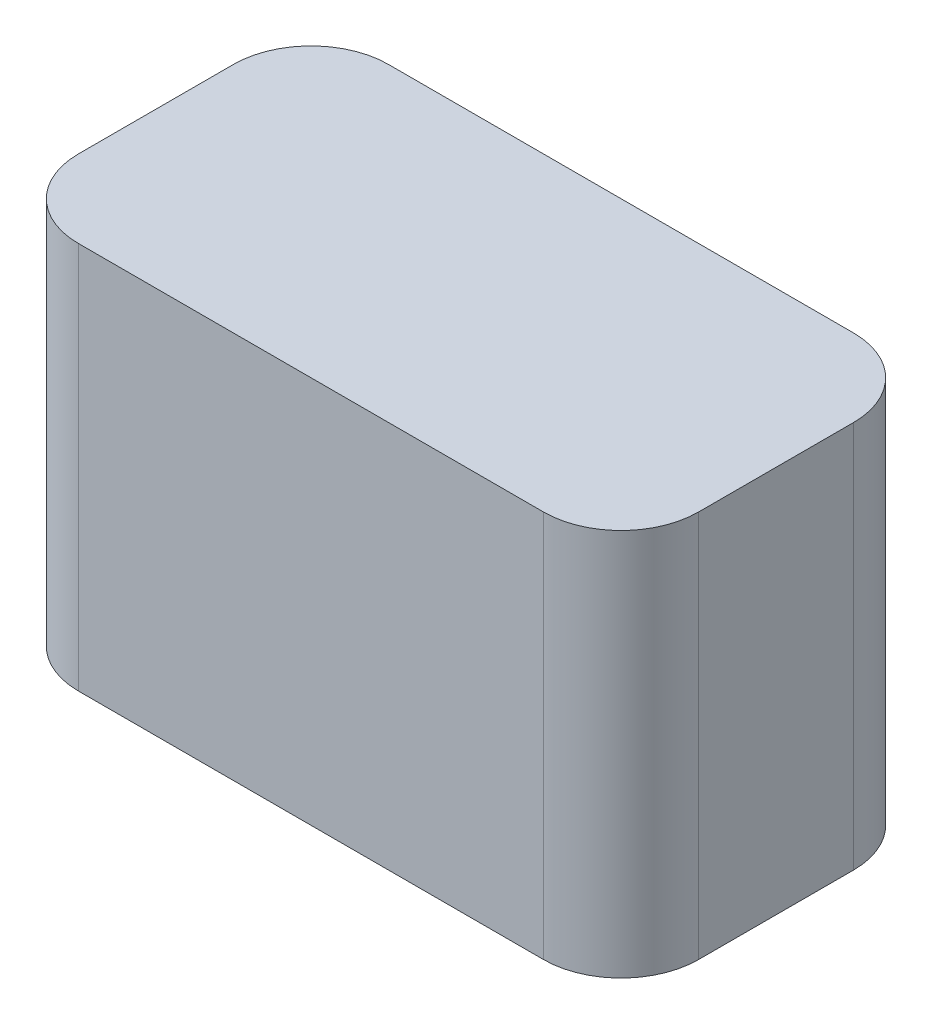
ISO-10303-21;
HEADER;
FILE_DESCRIPTION(('STEP AP214'),'2;1');
FILE_NAME('part.step','',(''),(''),'','','');
FILE_SCHEMA(('AUTOMOTIVE_DESIGN { 1 0 10303 214 1 1 1 1 }'));
ENDSEC;
DATA;
#1=APPLICATION_CONTEXT('core data for automotive mechanical design processes');
#2=APPLICATION_PROTOCOL_DEFINITION('international standard','automotive_design',2000,#1);
#3=PRODUCT_CONTEXT('',#1,'mechanical');
#4=PRODUCT('Part','Part','',(#3));
#5=PRODUCT_RELATED_PRODUCT_CATEGORY('part','',(#4));
#6=PRODUCT_DEFINITION_FORMATION('','',#4);
#7=PRODUCT_DEFINITION_CONTEXT('part definition',#1,'design');
#8=PRODUCT_DEFINITION('design','',#6,#7);
#9=PRODUCT_DEFINITION_SHAPE('','',#8);
#10=(LENGTH_UNIT() NAMED_UNIT(*) SI_UNIT(.MILLI.,.METRE.));
#11=(NAMED_UNIT(*) PLANE_ANGLE_UNIT() SI_UNIT($,.RADIAN.));
#12=(NAMED_UNIT(*) SI_UNIT($,.STERADIAN.) SOLID_ANGLE_UNIT());
#13=UNCERTAINTY_MEASURE_WITH_UNIT(LENGTH_MEASURE(1.E-05),#10,'distance_accuracy_value','');
#14=(GEOMETRIC_REPRESENTATION_CONTEXT(3) GLOBAL_UNCERTAINTY_ASSIGNED_CONTEXT((#13)) GLOBAL_UNIT_ASSIGNED_CONTEXT((#10,
#11,#12)) REPRESENTATION_CONTEXT('',''));
#15=CARTESIAN_POINT('',(0.,0.,0.));
#16=DIRECTION('',(0.,0.,1.));
#17=DIRECTION('',(1.,0.,0.));
#18=AXIS2_PLACEMENT_3D('',#15,#16,#17);
#19=CARTESIAN_POINT('',(-3.,5.,-1.));
#20=DIRECTION('',(0.,-1.,0.));
#21=DIRECTION('',(0.,0.,-1.));
#22=AXIS2_PLACEMENT_3D('',#19,#20,#21);
#23=CYLINDRICAL_SURFACE('',#22,1.);
#24=CARTESIAN_POINT('',(-3.,0.,-1.));
#25=DIRECTION('',(0.,1.,0.));
#26=DIRECTION('',(0.,0.,1.));
#27=AXIS2_PLACEMENT_3D('',#24,#25,#26);
#28=CIRCLE('',#27,1.);
#29=CARTESIAN_POINT('',(-2.99999999999999,0.,-2.));
#30=VERTEX_POINT('',#29);
#31=CARTESIAN_POINT('',(-4.,0.,-0.999999999999994));
#32=VERTEX_POINT('',#31);
#33=EDGE_CURVE('E129',#30,#32,#28,.T.);
#34=ORIENTED_EDGE('',*,*,#33,.T.);
#35=DIRECTION('',(0.,-1.,0.));
#36=VECTOR('',#35,1.);
#37=CARTESIAN_POINT('',(-4.,5.,-0.999999999999994));
#38=LINE('',#37,#36);
#39=CARTESIAN_POINT('',(-4.,5.,-0.999999999999994));
#40=VERTEX_POINT('',#39);
#41=EDGE_CURVE('E11',#40,#32,#38,.T.);
#42=ORIENTED_EDGE('',*,*,#41,.F.);
#43=CARTESIAN_POINT('',(-3.,5.,-1.));
#44=DIRECTION('',(0.,1.,0.));
#45=DIRECTION('',(0.,0.,1.));
#46=AXIS2_PLACEMENT_3D('',#43,#44,#45);
#47=CIRCLE('',#46,1.);
#48=CARTESIAN_POINT('',(-2.99999999999999,5.,-2.));
#49=VERTEX_POINT('',#48);
#50=EDGE_CURVE('E143',#49,#40,#47,.T.);
#51=ORIENTED_EDGE('',*,*,#50,.F.);
#52=DIRECTION('',(0.,-1.,0.));
#53=VECTOR('',#52,1.);
#54=CARTESIAN_POINT('',(-2.99999999999999,5.,-2.));
#55=LINE('',#54,#53);
#56=EDGE_CURVE('E125',#49,#30,#55,.T.);
#57=ORIENTED_EDGE('',*,*,#56,.T.);
#58=EDGE_LOOP('',(#34,#42,#51,#57));
#59=FACE_BOUND('',#58,.T.);
#60=ADVANCED_FACE('F33',(#59),#23,.T.);
#61=CARTESIAN_POINT('',(-4.,5.,-0.999999999999994));
#62=DIRECTION('',(1.,0.,0.));
#63=DIRECTION('',(0.,0.,-1.));
#64=AXIS2_PLACEMENT_3D('',#61,#62,#63);
#65=PLANE('',#64);
#66=DIRECTION('',(0.,0.,1.));
#67=VECTOR('',#66,1.);
#68=CARTESIAN_POINT('',(-4.,0.,-0.999999999999994));
#69=LINE('',#68,#67);
#70=CARTESIAN_POINT('',(-4.,0.,0.999999999999992));
#71=VERTEX_POINT('',#70);
#72=EDGE_CURVE('E132',#32,#71,#69,.T.);
#73=ORIENTED_EDGE('',*,*,#72,.T.);
#74=DIRECTION('',(0.,-1.,0.));
#75=VECTOR('',#74,1.);
#76=CARTESIAN_POINT('',(-4.,5.,0.999999999999992));
#77=LINE('',#76,#75);
#78=CARTESIAN_POINT('',(-4.,5.,0.999999999999992));
#79=VERTEX_POINT('',#78);
#80=EDGE_CURVE('E41',#79,#71,#77,.T.);
#81=ORIENTED_EDGE('',*,*,#80,.F.);
#82=DIRECTION('',(0.,0.,1.));
#83=VECTOR('',#82,1.);
#84=CARTESIAN_POINT('',(-4.,5.,-0.999999999999994));
#85=LINE('',#84,#83);
#86=EDGE_CURVE('E92',#40,#79,#85,.T.);
#87=ORIENTED_EDGE('',*,*,#86,.F.);
#88=ORIENTED_EDGE('',*,*,#41,.T.);
#89=EDGE_LOOP('',(#73,#81,#87,#88));
#90=FACE_BOUND('',#89,.T.);
#91=ADVANCED_FACE('F178',(#90),#65,.F.);
#92=CARTESIAN_POINT('',(-3.,5.,0.999999999999999));
#93=DIRECTION('',(0.,-1.,0.));
#94=DIRECTION('',(0.,0.,-1.));
#95=AXIS2_PLACEMENT_3D('',#92,#93,#94);
#96=CYLINDRICAL_SURFACE('',#95,1.);
#97=CARTESIAN_POINT('',(-3.,0.,0.999999999999999));
#98=DIRECTION('',(0.,1.,0.));
#99=DIRECTION('',(0.,0.,1.));
#100=AXIS2_PLACEMENT_3D('',#97,#98,#99);
#101=CIRCLE('',#100,1.);
#102=CARTESIAN_POINT('',(-2.99999999999999,0.,2.));
#103=VERTEX_POINT('',#102);
#104=EDGE_CURVE('E134',#71,#103,#101,.T.);
#105=ORIENTED_EDGE('',*,*,#104,.T.);
#106=DIRECTION('',(0.,-1.,0.));
#107=VECTOR('',#106,1.);
#108=CARTESIAN_POINT('',(-2.99999999999999,5.,2.));
#109=LINE('',#108,#107);
#110=CARTESIAN_POINT('',(-2.99999999999999,5.,2.));
#111=VERTEX_POINT('',#110);
#112=EDGE_CURVE('E150',#111,#103,#109,.T.);
#113=ORIENTED_EDGE('',*,*,#112,.F.);
#114=CARTESIAN_POINT('',(-3.,5.,0.999999999999999));
#115=DIRECTION('',(0.,1.,0.));
#116=DIRECTION('',(0.,0.,1.));
#117=AXIS2_PLACEMENT_3D('',#114,#115,#116);
#118=CIRCLE('',#117,1.);
#119=EDGE_CURVE('E158',#79,#111,#118,.T.);
#120=ORIENTED_EDGE('',*,*,#119,.F.);
#121=ORIENTED_EDGE('',*,*,#80,.T.);
#122=EDGE_LOOP('',(#105,#113,#120,#121));
#123=FACE_BOUND('',#122,.T.);
#124=ADVANCED_FACE('F156',(#123),#96,.T.);
#125=CARTESIAN_POINT('',(-2.99999999999999,5.,2.));
#126=DIRECTION('',(0.,0.,-1.));
#127=DIRECTION('',(-1.,0.,0.));
#128=AXIS2_PLACEMENT_3D('',#125,#126,#127);
#129=PLANE('',#128);
#130=DIRECTION('',(1.,0.,0.));
#131=VECTOR('',#130,1.);
#132=CARTESIAN_POINT('',(-2.99999999999999,0.,2.));
#133=LINE('',#132,#131);
#134=CARTESIAN_POINT('',(2.99999999999999,0.,2.));
#135=VERTEX_POINT('',#134);
#136=EDGE_CURVE('E136',#103,#135,#133,.T.);
#137=ORIENTED_EDGE('',*,*,#136,.T.);
#138=DIRECTION('',(0.,-1.,0.));
#139=VECTOR('',#138,1.);
#140=CARTESIAN_POINT('',(2.99999999999999,5.,2.));
#141=LINE('',#140,#139);
#142=CARTESIAN_POINT('',(2.99999999999999,5.,2.));
#143=VERTEX_POINT('',#142);
#144=EDGE_CURVE('E147',#143,#135,#141,.T.);
#145=ORIENTED_EDGE('',*,*,#144,.F.);
#146=DIRECTION('',(1.,0.,0.));
#147=VECTOR('',#146,1.);
#148=CARTESIAN_POINT('',(-2.99999999999999,5.,2.));
#149=LINE('',#148,#147);
#150=EDGE_CURVE('E170',#111,#143,#149,.T.);
#151=ORIENTED_EDGE('',*,*,#150,.F.);
#152=ORIENTED_EDGE('',*,*,#112,.T.);
#153=EDGE_LOOP('',(#137,#145,#151,#152));
#154=FACE_BOUND('',#153,.T.);
#155=ADVANCED_FACE('F166',(#154),#129,.F.);
#156=CARTESIAN_POINT('',(3.,5.,0.999999999999999));
#157=DIRECTION('',(0.,-1.,0.));
#158=DIRECTION('',(0.,0.,-1.));
#159=AXIS2_PLACEMENT_3D('',#156,#157,#158);
#160=CYLINDRICAL_SURFACE('',#159,1.);
#161=CARTESIAN_POINT('',(3.,0.,0.999999999999999));
#162=DIRECTION('',(0.,1.,0.));
#163=DIRECTION('',(0.,0.,-1.));
#164=AXIS2_PLACEMENT_3D('',#161,#162,#163);
#165=CIRCLE('',#164,1.);
#166=CARTESIAN_POINT('',(4.,0.,0.999999999999992));
#167=VERTEX_POINT('',#166);
#168=EDGE_CURVE('E138',#135,#167,#165,.T.);
#169=ORIENTED_EDGE('',*,*,#168,.T.);
#170=DIRECTION('',(0.,-1.,0.));
#171=VECTOR('',#170,1.);
#172=CARTESIAN_POINT('',(4.,5.,0.999999999999992));
#173=LINE('',#172,#171);
#174=CARTESIAN_POINT('',(4.,5.,0.999999999999992));
#175=VERTEX_POINT('',#174);
#176=EDGE_CURVE('E120',#175,#167,#173,.T.);
#177=ORIENTED_EDGE('',*,*,#176,.F.);
#178=CARTESIAN_POINT('',(3.,5.,0.999999999999999));
#179=DIRECTION('',(0.,1.,0.));
#180=DIRECTION('',(0.,0.,-1.));
#181=AXIS2_PLACEMENT_3D('',#178,#179,#180);
#182=CIRCLE('',#181,1.);
#183=EDGE_CURVE('E111',#143,#175,#182,.T.);
#184=ORIENTED_EDGE('',*,*,#183,.F.);
#185=ORIENTED_EDGE('',*,*,#144,.T.);
#186=EDGE_LOOP('',(#169,#177,#184,#185));
#187=FACE_BOUND('',#186,.T.);
#188=ADVANCED_FACE('F169',(#187),#160,.T.);
#189=CARTESIAN_POINT('',(4.,5.,-0.999999999999994));
#190=DIRECTION('',(-1.,0.,0.));
#191=DIRECTION('',(0.,0.,1.));
#192=AXIS2_PLACEMENT_3D('',#189,#190,#191);
#193=PLANE('',#192);
#194=DIRECTION('',(0.,0.,-1.));
#195=VECTOR('',#194,1.);
#196=CARTESIAN_POINT('',(4.,0.,-0.999999999999994));
#197=LINE('',#196,#195);
#198=CARTESIAN_POINT('',(4.,0.,-0.999999999999994));
#199=VERTEX_POINT('',#198);
#200=EDGE_CURVE('E119',#167,#199,#197,.T.);
#201=ORIENTED_EDGE('',*,*,#200,.T.);
#202=DIRECTION('',(0.,-1.,0.));
#203=VECTOR('',#202,1.);
#204=CARTESIAN_POINT('',(4.,5.,-0.999999999999994));
#205=LINE('',#204,#203);
#206=CARTESIAN_POINT('',(4.,5.,-0.999999999999994));
#207=VERTEX_POINT('',#206);
#208=EDGE_CURVE('E116',#207,#199,#205,.T.);
#209=ORIENTED_EDGE('',*,*,#208,.F.);
#210=DIRECTION('',(0.,0.,-1.));
#211=VECTOR('',#210,1.);
#212=CARTESIAN_POINT('',(4.,5.,-0.999999999999994));
#213=LINE('',#212,#211);
#214=EDGE_CURVE('E105',#175,#207,#213,.T.);
#215=ORIENTED_EDGE('',*,*,#214,.F.);
#216=ORIENTED_EDGE('',*,*,#176,.T.);
#217=EDGE_LOOP('',(#201,#209,#215,#216));
#218=FACE_BOUND('',#217,.T.);
#219=ADVANCED_FACE('F117',(#218),#193,.F.);
#220=CARTESIAN_POINT('',(3.,5.,-1.));
#221=DIRECTION('',(0.,-1.,0.));
#222=DIRECTION('',(0.,0.,-1.));
#223=AXIS2_PLACEMENT_3D('',#220,#221,#222);
#224=CYLINDRICAL_SURFACE('',#223,1.);
#225=CARTESIAN_POINT('',(3.,0.,-1.));
#226=DIRECTION('',(0.,1.,0.));
#227=DIRECTION('',(0.,0.,-1.));
#228=AXIS2_PLACEMENT_3D('',#225,#226,#227);
#229=CIRCLE('',#228,1.);
#230=CARTESIAN_POINT('',(2.99999999999999,0.,-2.));
#231=VERTEX_POINT('',#230);
#232=EDGE_CURVE('E78',#199,#231,#229,.T.);
#233=ORIENTED_EDGE('',*,*,#232,.T.);
#234=DIRECTION('',(0.,-1.,0.));
#235=VECTOR('',#234,1.);
#236=CARTESIAN_POINT('',(2.99999999999999,5.,-2.));
#237=LINE('',#236,#235);
#238=CARTESIAN_POINT('',(2.99999999999999,5.,-2.));
#239=VERTEX_POINT('',#238);
#240=EDGE_CURVE('E121',#239,#231,#237,.T.);
#241=ORIENTED_EDGE('',*,*,#240,.F.);
#242=CARTESIAN_POINT('',(3.,5.,-1.));
#243=DIRECTION('',(0.,1.,0.));
#244=DIRECTION('',(0.,0.,-1.));
#245=AXIS2_PLACEMENT_3D('',#242,#243,#244);
#246=CIRCLE('',#245,1.);
#247=EDGE_CURVE('E109',#207,#239,#246,.T.);
#248=ORIENTED_EDGE('',*,*,#247,.F.);
#249=ORIENTED_EDGE('',*,*,#208,.T.);
#250=EDGE_LOOP('',(#233,#241,#248,#249));
#251=FACE_BOUND('',#250,.T.);
#252=ADVANCED_FACE('F123',(#251),#224,.T.);
#253=CARTESIAN_POINT('',(-2.99999999999999,5.,-2.));
#254=DIRECTION('',(0.,0.,1.));
#255=DIRECTION('',(1.,0.,0.));
#256=AXIS2_PLACEMENT_3D('',#253,#254,#255);
#257=PLANE('',#256);
#258=DIRECTION('',(-1.,0.,0.));
#259=VECTOR('',#258,1.);
#260=CARTESIAN_POINT('',(-2.99999999999999,0.,-2.));
#261=LINE('',#260,#259);
#262=EDGE_CURVE('E84',#231,#30,#261,.T.);
#263=ORIENTED_EDGE('',*,*,#262,.T.);
#264=ORIENTED_EDGE('',*,*,#56,.F.);
#265=DIRECTION('',(-1.,0.,0.));
#266=VECTOR('',#265,1.);
#267=CARTESIAN_POINT('',(-2.99999999999999,5.,-2.));
#268=LINE('',#267,#266);
#269=EDGE_CURVE('E49',#239,#49,#268,.T.);
#270=ORIENTED_EDGE('',*,*,#269,.F.);
#271=ORIENTED_EDGE('',*,*,#240,.T.);
#272=EDGE_LOOP('',(#263,#264,#270,#271));
#273=FACE_BOUND('',#272,.T.);
#274=ADVANCED_FACE('F194',(#273),#257,.F.);
#275=CARTESIAN_POINT('',(-3.,5.,-1.));
#276=DIRECTION('',(0.,1.,0.));
#277=DIRECTION('',(0.,0.,1.));
#278=AXIS2_PLACEMENT_3D('',#275,#276,#277);
#279=PLANE('',#278);
#280=ORIENTED_EDGE('',*,*,#50,.T.);
#281=ORIENTED_EDGE('',*,*,#86,.T.);
#282=ORIENTED_EDGE('',*,*,#119,.T.);
#283=ORIENTED_EDGE('',*,*,#150,.T.);
#284=ORIENTED_EDGE('',*,*,#183,.T.);
#285=ORIENTED_EDGE('',*,*,#214,.T.);
#286=ORIENTED_EDGE('',*,*,#247,.T.);
#287=ORIENTED_EDGE('',*,*,#269,.T.);
#288=EDGE_LOOP('',(#280,#281,#282,#283,#284,#285,#286,#287));
#289=FACE_BOUND('',#288,.T.);
#290=ADVANCED_FACE('F107',(#289),#279,.T.);
#291=CARTESIAN_POINT('',(-3.,0.,-1.));
#292=DIRECTION('',(0.,1.,0.));
#293=DIRECTION('',(0.,0.,1.));
#294=AXIS2_PLACEMENT_3D('',#291,#292,#293);
#295=PLANE('',#294);
#296=ORIENTED_EDGE('',*,*,#33,.F.);
#297=ORIENTED_EDGE('',*,*,#262,.F.);
#298=ORIENTED_EDGE('',*,*,#232,.F.);
#299=ORIENTED_EDGE('',*,*,#200,.F.);
#300=ORIENTED_EDGE('',*,*,#168,.F.);
#301=ORIENTED_EDGE('',*,*,#136,.F.);
#302=ORIENTED_EDGE('',*,*,#104,.F.);
#303=ORIENTED_EDGE('',*,*,#72,.F.);
#304=EDGE_LOOP('',(#296,#297,#298,#299,#300,#301,#302,#303));
#305=FACE_BOUND('',#304,.T.);
#306=ADVANCED_FACE('F162',(#305),#295,.F.);
#307=CLOSED_SHELL('',(#60,#91,#124,#155,#188,#219,#252,#274,#290,#306));
#308=MANIFOLD_SOLID_BREP('B2',#307);
#309=ADVANCED_BREP_SHAPE_REPRESENTATION('',(#18,#308),#14);
#310=SHAPE_DEFINITION_REPRESENTATION(#9,#309);
ENDSEC;
END-ISO-10303-21;
